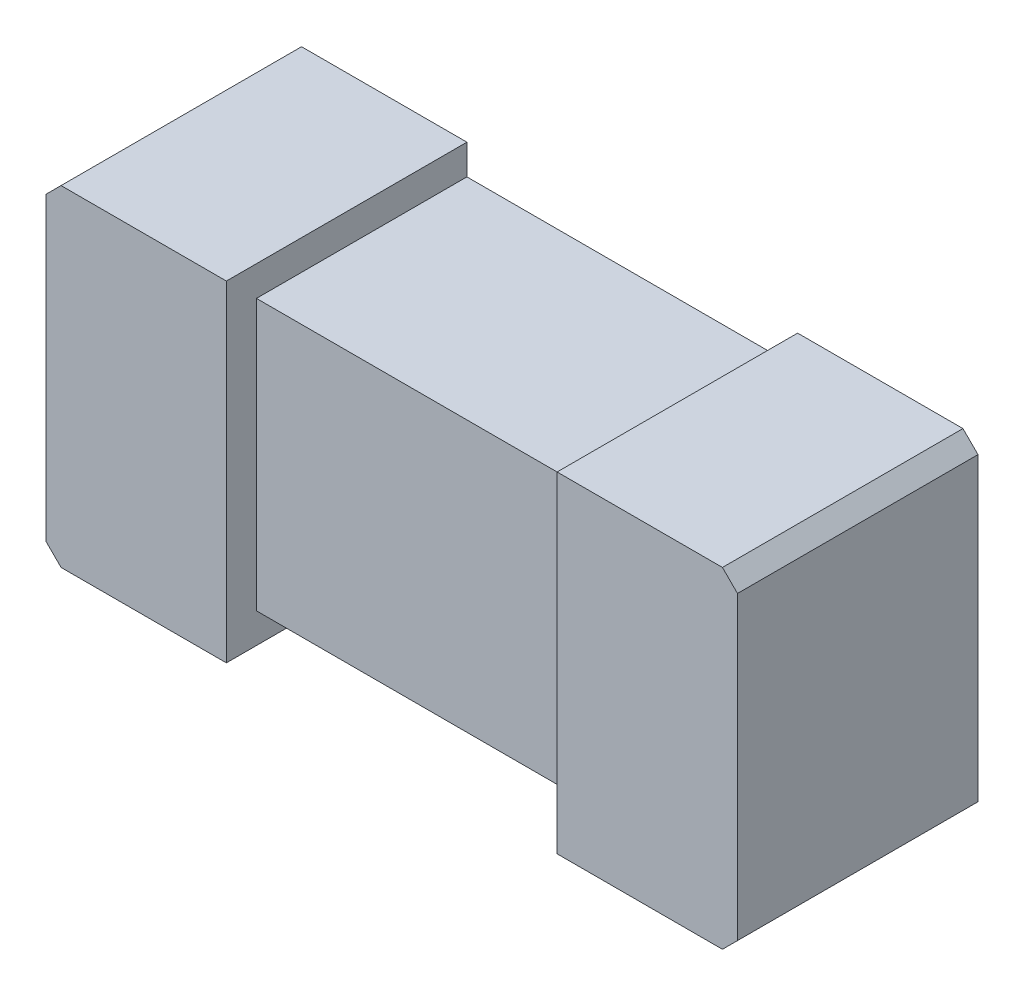
ISO-10303-21;
HEADER;
FILE_DESCRIPTION(('STEP AP214'),'2;1');
FILE_NAME('part.step','',(''),(''),'','','');
FILE_SCHEMA(('AUTOMOTIVE_DESIGN { 1 0 10303 214 1 1 1 1 }'));
ENDSEC;
DATA;
#1=APPLICATION_CONTEXT('core data for automotive mechanical design processes');
#2=APPLICATION_PROTOCOL_DEFINITION('international standard','automotive_design',2000,#1);
#3=PRODUCT_CONTEXT('',#1,'mechanical');
#4=PRODUCT('Part','Part','',(#3));
#5=PRODUCT_RELATED_PRODUCT_CATEGORY('part','',(#4));
#6=PRODUCT_DEFINITION_FORMATION('','',#4);
#7=PRODUCT_DEFINITION_CONTEXT('part definition',#1,'design');
#8=PRODUCT_DEFINITION('design','',#6,#7);
#9=PRODUCT_DEFINITION_SHAPE('','',#8);
#10=(LENGTH_UNIT() NAMED_UNIT(*) SI_UNIT(.MILLI.,.METRE.));
#11=(NAMED_UNIT(*) PLANE_ANGLE_UNIT() SI_UNIT($,.RADIAN.));
#12=(NAMED_UNIT(*) SI_UNIT($,.STERADIAN.) SOLID_ANGLE_UNIT());
#13=UNCERTAINTY_MEASURE_WITH_UNIT(LENGTH_MEASURE(1.E-05),#10,'distance_accuracy_value','');
#14=(GEOMETRIC_REPRESENTATION_CONTEXT(3) GLOBAL_UNCERTAINTY_ASSIGNED_CONTEXT((#13)) GLOBAL_UNIT_ASSIGNED_CONTEXT((#10,
#11,#12)) REPRESENTATION_CONTEXT('',''));
#15=CARTESIAN_POINT('',(0.,0.,0.));
#16=DIRECTION('',(0.,0.,1.));
#17=DIRECTION('',(1.,0.,0.));
#18=AXIS2_PLACEMENT_3D('',#15,#16,#17);
#19=CARTESIAN_POINT('',(0.,0.825000000000002,0.4));
#20=DIRECTION('',(0.,0.,1.));
#21=DIRECTION('',(1.,0.,0.));
#22=AXIS2_PLACEMENT_3D('',#19,#20,#21);
#23=PLANE('',#22);
#24=DIRECTION('',(-1.,0.,0.));
#25=VECTOR('',#24,1.);
#26=CARTESIAN_POINT('',(0.55,0.275,0.4));
#27=LINE('',#26,#25);
#28=CARTESIAN_POINT('',(0.55,0.275,0.4));
#29=VERTEX_POINT('',#28);
#30=CARTESIAN_POINT('',(0.275,0.275,0.4));
#31=VERTEX_POINT('',#30);
#32=EDGE_CURVE('E204',#29,#31,#27,.T.);
#33=ORIENTED_EDGE('',*,*,#32,.T.);
#34=DIRECTION('',(0.,1.,0.));
#35=VECTOR('',#34,1.);
#36=CARTESIAN_POINT('',(0.275,-0.275,0.4));
#37=LINE('',#36,#35);
#38=CARTESIAN_POINT('',(0.275,-0.275,0.4));
#39=VERTEX_POINT('',#38);
#40=EDGE_CURVE('E281',#39,#31,#37,.T.);
#41=ORIENTED_EDGE('',*,*,#40,.F.);
#42=DIRECTION('',(1.,0.,0.));
#43=VECTOR('',#42,1.);
#44=CARTESIAN_POINT('',(-0.55,-0.275,0.4));
#45=LINE('',#44,#43);
#46=CARTESIAN_POINT('',(0.55,-0.275,0.4));
#47=VERTEX_POINT('',#46);
#48=EDGE_CURVE('E213',#39,#47,#45,.T.);
#49=ORIENTED_EDGE('',*,*,#48,.T.);
#50=DIRECTION('',(0.707106781186547,0.707106781186548,0.));
#51=VECTOR('',#50,1.);
#52=CARTESIAN_POINT('',(0.55,-0.275,0.4));
#53=LINE('',#52,#51);
#54=CARTESIAN_POINT('',(0.575,-0.25,0.4));
#55=VERTEX_POINT('',#54);
#56=EDGE_CURVE('E217',#47,#55,#53,.T.);
#57=ORIENTED_EDGE('',*,*,#56,.T.);
#58=DIRECTION('',(0.,1.,0.));
#59=VECTOR('',#58,1.);
#60=CARTESIAN_POINT('',(0.575,-0.25,0.4));
#61=LINE('',#60,#59);
#62=CARTESIAN_POINT('',(0.575,0.25,0.4));
#63=VERTEX_POINT('',#62);
#64=EDGE_CURVE('E219',#55,#63,#61,.T.);
#65=ORIENTED_EDGE('',*,*,#64,.T.);
#66=DIRECTION('',(-0.707106781186547,0.707106781186548,0.));
#67=VECTOR('',#66,1.);
#68=CARTESIAN_POINT('',(0.575,0.25,0.4));
#69=LINE('',#68,#67);
#70=EDGE_CURVE('E200',#63,#29,#69,.T.);
#71=ORIENTED_EDGE('',*,*,#70,.T.);
#72=EDGE_LOOP('',(#33,#41,#49,#57,#65,#71));
#73=FACE_BOUND('',#72,.T.);
#74=ADVANCED_FACE('F36',(#73),#23,.T.);
#75=CARTESIAN_POINT('',(0.55,0.275,0.4));
#76=DIRECTION('',(0.,-1.,0.));
#77=DIRECTION('',(0.,0.,-1.));
#78=AXIS2_PLACEMENT_3D('',#75,#76,#77);
#79=PLANE('',#78);
#80=CARTESIAN_POINT('',(-0.275,0.275,0.4));
#81=VERTEX_POINT('',#80);
#82=CARTESIAN_POINT('',(-0.55,0.275,0.4));
#83=VERTEX_POINT('',#82);
#84=EDGE_CURVE('E203',#81,#83,#27,.T.);
#85=ORIENTED_EDGE('',*,*,#84,.F.);
#86=DIRECTION('',(0.,0.,1.));
#87=VECTOR('',#86,1.);
#88=CARTESIAN_POINT('',(-0.275,0.275,0.));
#89=LINE('',#88,#87);
#90=CARTESIAN_POINT('',(-0.275,0.275,0.));
#91=VERTEX_POINT('',#90);
#92=EDGE_CURVE('E269',#91,#81,#89,.T.);
#93=ORIENTED_EDGE('',*,*,#92,.F.);
#94=DIRECTION('',(-1.,0.,0.));
#95=VECTOR('',#94,1.);
#96=CARTESIAN_POINT('',(0.55,0.275,0.));
#97=LINE('',#96,#95);
#98=CARTESIAN_POINT('',(-0.55,0.275,0.));
#99=VERTEX_POINT('',#98);
#100=EDGE_CURVE('E182',#91,#99,#97,.T.);
#101=ORIENTED_EDGE('',*,*,#100,.T.);
#102=DIRECTION('',(0.,0.,-1.));
#103=VECTOR('',#102,1.);
#104=CARTESIAN_POINT('',(-0.55,0.275,0.4));
#105=LINE('',#104,#103);
#106=EDGE_CURVE('E44',#83,#99,#105,.T.);
#107=ORIENTED_EDGE('',*,*,#106,.F.);
#108=EDGE_LOOP('',(#85,#93,#101,#107));
#109=FACE_BOUND('',#108,.T.);
#110=ADVANCED_FACE('F268',(#109),#79,.F.);
#111=CARTESIAN_POINT('',(-0.55,-0.275,0.4));
#112=DIRECTION('',(0.,1.,0.));
#113=DIRECTION('',(0.,0.,1.));
#114=AXIS2_PLACEMENT_3D('',#111,#112,#113);
#115=PLANE('',#114);
#116=ORIENTED_EDGE('',*,*,#48,.F.);
#117=DIRECTION('',(0.,0.,1.));
#118=VECTOR('',#117,1.);
#119=CARTESIAN_POINT('',(0.275,-0.275,0.));
#120=LINE('',#119,#118);
#121=CARTESIAN_POINT('',(0.275,-0.275,0.));
#122=VERTEX_POINT('',#121);
#123=EDGE_CURVE('E173',#122,#39,#120,.T.);
#124=ORIENTED_EDGE('',*,*,#123,.F.);
#125=DIRECTION('',(1.,0.,0.));
#126=VECTOR('',#125,1.);
#127=CARTESIAN_POINT('',(-0.55,-0.275,0.));
#128=LINE('',#127,#126);
#129=CARTESIAN_POINT('',(0.55,-0.275,0.));
#130=VERTEX_POINT('',#129);
#131=EDGE_CURVE('E192',#122,#130,#128,.T.);
#132=ORIENTED_EDGE('',*,*,#131,.T.);
#133=DIRECTION('',(0.,0.,-1.));
#134=VECTOR('',#133,1.);
#135=CARTESIAN_POINT('',(0.55,-0.275,0.4));
#136=LINE('',#135,#134);
#137=EDGE_CURVE('E227',#47,#130,#136,.T.);
#138=ORIENTED_EDGE('',*,*,#137,.F.);
#139=EDGE_LOOP('',(#116,#124,#132,#138));
#140=FACE_BOUND('',#139,.T.);
#141=ADVANCED_FACE('F294',(#140),#115,.F.);
#142=CARTESIAN_POINT('',(0.575,0.25,0.4));
#143=DIRECTION('',(-0.707106781186548,-0.707106781186547,0.));
#144=DIRECTION('',(0.707106781186547,-0.707106781186548,0.));
#145=AXIS2_PLACEMENT_3D('',#142,#143,#144);
#146=PLANE('',#145);
#147=DIRECTION('',(-0.707106781186547,0.707106781186548,0.));
#148=VECTOR('',#147,1.);
#149=CARTESIAN_POINT('',(0.575,0.25,0.));
#150=LINE('',#149,#148);
#151=CARTESIAN_POINT('',(0.575,0.25,0.));
#152=VERTEX_POINT('',#151);
#153=CARTESIAN_POINT('',(0.55,0.275,0.));
#154=VERTEX_POINT('',#153);
#155=EDGE_CURVE('E179',#152,#154,#150,.T.);
#156=ORIENTED_EDGE('',*,*,#155,.T.);
#157=DIRECTION('',(0.,0.,-1.));
#158=VECTOR('',#157,1.);
#159=CARTESIAN_POINT('',(0.55,0.275,0.4));
#160=LINE('',#159,#158);
#161=EDGE_CURVE('E11',#29,#154,#160,.T.);
#162=ORIENTED_EDGE('',*,*,#161,.F.);
#163=ORIENTED_EDGE('',*,*,#70,.F.);
#164=DIRECTION('',(0.,0.,-1.));
#165=VECTOR('',#164,1.);
#166=CARTESIAN_POINT('',(0.575,0.25,0.4));
#167=LINE('',#166,#165);
#168=EDGE_CURVE('E221',#63,#152,#167,.T.);
#169=ORIENTED_EDGE('',*,*,#168,.T.);
#170=EDGE_LOOP('',(#156,#162,#163,#169));
#171=FACE_BOUND('',#170,.T.);
#172=ADVANCED_FACE('F38',(#171),#146,.F.);
#173=CARTESIAN_POINT('',(0.275,0.275,0.));
#174=VERTEX_POINT('',#173);
#175=EDGE_CURVE('E183',#154,#174,#97,.T.);
#176=ORIENTED_EDGE('',*,*,#175,.T.);
#177=DIRECTION('',(0.,0.,1.));
#178=VECTOR('',#177,1.);
#179=CARTESIAN_POINT('',(0.275,0.275,0.));
#180=LINE('',#179,#178);
#181=EDGE_CURVE('E59',#174,#31,#180,.T.);
#182=ORIENTED_EDGE('',*,*,#181,.T.);
#183=ORIENTED_EDGE('',*,*,#32,.F.);
#184=ORIENTED_EDGE('',*,*,#161,.T.);
#185=EDGE_LOOP('',(#176,#182,#183,#184));
#186=FACE_BOUND('',#185,.T.);
#187=ADVANCED_FACE('F310',(#186),#79,.F.);
#188=CARTESIAN_POINT('',(-0.55,0.275,0.4));
#189=DIRECTION('',(0.707106781186548,-0.707106781186547,0.));
#190=DIRECTION('',(0.707106781186547,0.707106781186548,0.));
#191=AXIS2_PLACEMENT_3D('',#188,#189,#190);
#192=PLANE('',#191);
#193=DIRECTION('',(-0.707106781186547,-0.707106781186548,0.));
#194=VECTOR('',#193,1.);
#195=CARTESIAN_POINT('',(-0.55,0.275,0.));
#196=LINE('',#195,#194);
#197=CARTESIAN_POINT('',(-0.575,0.25,0.));
#198=VERTEX_POINT('',#197);
#199=EDGE_CURVE('E186',#99,#198,#196,.T.);
#200=ORIENTED_EDGE('',*,*,#199,.T.);
#201=DIRECTION('',(0.,0.,-1.));
#202=VECTOR('',#201,1.);
#203=CARTESIAN_POINT('',(-0.575,0.25,0.4));
#204=LINE('',#203,#202);
#205=CARTESIAN_POINT('',(-0.575,0.25,0.4));
#206=VERTEX_POINT('',#205);
#207=EDGE_CURVE('E236',#206,#198,#204,.T.);
#208=ORIENTED_EDGE('',*,*,#207,.F.);
#209=DIRECTION('',(-0.707106781186547,-0.707106781186548,0.));
#210=VECTOR('',#209,1.);
#211=CARTESIAN_POINT('',(-0.55,0.275,0.4));
#212=LINE('',#211,#210);
#213=EDGE_CURVE('E207',#83,#206,#212,.T.);
#214=ORIENTED_EDGE('',*,*,#213,.F.);
#215=ORIENTED_EDGE('',*,*,#106,.T.);
#216=EDGE_LOOP('',(#200,#208,#214,#215));
#217=FACE_BOUND('',#216,.T.);
#218=ADVANCED_FACE('F243',(#217),#192,.F.);
#219=CARTESIAN_POINT('',(-0.575,0.25,0.4));
#220=DIRECTION('',(1.,0.,0.));
#221=DIRECTION('',(0.,0.,-1.));
#222=AXIS2_PLACEMENT_3D('',#219,#220,#221);
#223=PLANE('',#222);
#224=DIRECTION('',(0.,-1.,0.));
#225=VECTOR('',#224,1.);
#226=CARTESIAN_POINT('',(-0.575,0.25,0.));
#227=LINE('',#226,#225);
#228=CARTESIAN_POINT('',(-0.575,-0.25,0.));
#229=VERTEX_POINT('',#228);
#230=EDGE_CURVE('E188',#198,#229,#227,.T.);
#231=ORIENTED_EDGE('',*,*,#230,.T.);
#232=DIRECTION('',(0.,0.,-1.));
#233=VECTOR('',#232,1.);
#234=CARTESIAN_POINT('',(-0.575,-0.25,0.4));
#235=LINE('',#234,#233);
#236=CARTESIAN_POINT('',(-0.575,-0.25,0.4));
#237=VERTEX_POINT('',#236);
#238=EDGE_CURVE('E233',#237,#229,#235,.T.);
#239=ORIENTED_EDGE('',*,*,#238,.F.);
#240=DIRECTION('',(0.,-1.,0.));
#241=VECTOR('',#240,1.);
#242=CARTESIAN_POINT('',(-0.575,0.25,0.4));
#243=LINE('',#242,#241);
#244=EDGE_CURVE('E209',#206,#237,#243,.T.);
#245=ORIENTED_EDGE('',*,*,#244,.F.);
#246=ORIENTED_EDGE('',*,*,#207,.T.);
#247=EDGE_LOOP('',(#231,#239,#245,#246));
#248=FACE_BOUND('',#247,.T.);
#249=ADVANCED_FACE('F256',(#248),#223,.F.);
#250=CARTESIAN_POINT('',(-0.575,-0.25,0.4));
#251=DIRECTION('',(0.707106781186548,0.707106781186547,0.));
#252=DIRECTION('',(-0.707106781186547,0.707106781186548,0.));
#253=AXIS2_PLACEMENT_3D('',#250,#251,#252);
#254=PLANE('',#253);
#255=DIRECTION('',(0.707106781186547,-0.707106781186548,0.));
#256=VECTOR('',#255,1.);
#257=CARTESIAN_POINT('',(-0.575,-0.25,0.));
#258=LINE('',#257,#256);
#259=CARTESIAN_POINT('',(-0.55,-0.275,0.));
#260=VERTEX_POINT('',#259);
#261=EDGE_CURVE('E190',#229,#260,#258,.T.);
#262=ORIENTED_EDGE('',*,*,#261,.T.);
#263=DIRECTION('',(0.,0.,-1.));
#264=VECTOR('',#263,1.);
#265=CARTESIAN_POINT('',(-0.55,-0.275,0.4));
#266=LINE('',#265,#264);
#267=CARTESIAN_POINT('',(-0.55,-0.275,0.4));
#268=VERTEX_POINT('',#267);
#269=EDGE_CURVE('E230',#268,#260,#266,.T.);
#270=ORIENTED_EDGE('',*,*,#269,.F.);
#271=DIRECTION('',(0.707106781186547,-0.707106781186548,0.));
#272=VECTOR('',#271,1.);
#273=CARTESIAN_POINT('',(-0.575,-0.25,0.4));
#274=LINE('',#273,#272);
#275=EDGE_CURVE('E211',#237,#268,#274,.T.);
#276=ORIENTED_EDGE('',*,*,#275,.F.);
#277=ORIENTED_EDGE('',*,*,#238,.T.);
#278=EDGE_LOOP('',(#262,#270,#276,#277));
#279=FACE_BOUND('',#278,.T.);
#280=ADVANCED_FACE('F260',(#279),#254,.F.);
#281=CARTESIAN_POINT('',(-0.275,-0.275,0.));
#282=VERTEX_POINT('',#281);
#283=EDGE_CURVE('E193',#260,#282,#128,.T.);
#284=ORIENTED_EDGE('',*,*,#283,.T.);
#285=DIRECTION('',(0.,0.,1.));
#286=VECTOR('',#285,1.);
#287=CARTESIAN_POINT('',(-0.275,-0.275,0.));
#288=LINE('',#287,#286);
#289=CARTESIAN_POINT('',(-0.275,-0.275,0.4));
#290=VERTEX_POINT('',#289);
#291=EDGE_CURVE('E169',#282,#290,#288,.T.);
#292=ORIENTED_EDGE('',*,*,#291,.T.);
#293=EDGE_CURVE('E214',#268,#290,#45,.T.);
#294=ORIENTED_EDGE('',*,*,#293,.F.);
#295=ORIENTED_EDGE('',*,*,#269,.T.);
#296=EDGE_LOOP('',(#284,#292,#294,#295));
#297=FACE_BOUND('',#296,.T.);
#298=ADVANCED_FACE('F345',(#297),#115,.F.);
#299=CARTESIAN_POINT('',(0.55,-0.275,0.4));
#300=DIRECTION('',(-0.707106781186548,0.707106781186547,0.));
#301=DIRECTION('',(-0.707106781186547,-0.707106781186548,0.));
#302=AXIS2_PLACEMENT_3D('',#299,#300,#301);
#303=PLANE('',#302);
#304=DIRECTION('',(0.707106781186547,0.707106781186548,0.));
#305=VECTOR('',#304,1.);
#306=CARTESIAN_POINT('',(0.55,-0.275,0.));
#307=LINE('',#306,#305);
#308=CARTESIAN_POINT('',(0.575,-0.25,0.));
#309=VERTEX_POINT('',#308);
#310=EDGE_CURVE('E196',#130,#309,#307,.T.);
#311=ORIENTED_EDGE('',*,*,#310,.T.);
#312=DIRECTION('',(0.,0.,-1.));
#313=VECTOR('',#312,1.);
#314=CARTESIAN_POINT('',(0.575,-0.25,0.4));
#315=LINE('',#314,#313);
#316=EDGE_CURVE('E224',#55,#309,#315,.T.);
#317=ORIENTED_EDGE('',*,*,#316,.F.);
#318=ORIENTED_EDGE('',*,*,#56,.F.);
#319=ORIENTED_EDGE('',*,*,#137,.T.);
#320=EDGE_LOOP('',(#311,#317,#318,#319));
#321=FACE_BOUND('',#320,.T.);
#322=ADVANCED_FACE('F299',(#321),#303,.F.);
#323=CARTESIAN_POINT('',(0.575,-0.25,0.4));
#324=DIRECTION('',(-1.,0.,0.));
#325=DIRECTION('',(0.,0.,1.));
#326=AXIS2_PLACEMENT_3D('',#323,#324,#325);
#327=PLANE('',#326);
#328=DIRECTION('',(0.,1.,0.));
#329=VECTOR('',#328,1.);
#330=CARTESIAN_POINT('',(0.575,-0.25,0.));
#331=LINE('',#330,#329);
#332=EDGE_CURVE('E198',#309,#152,#331,.T.);
#333=ORIENTED_EDGE('',*,*,#332,.T.);
#334=ORIENTED_EDGE('',*,*,#168,.F.);
#335=ORIENTED_EDGE('',*,*,#64,.F.);
#336=ORIENTED_EDGE('',*,*,#316,.T.);
#337=EDGE_LOOP('',(#333,#334,#335,#336));
#338=FACE_BOUND('',#337,.T.);
#339=ADVANCED_FACE('F305',(#338),#327,.F.);
#340=DIRECTION('',(0.,-1.,0.));
#341=VECTOR('',#340,1.);
#342=CARTESIAN_POINT('',(-0.275,-0.225,0.4));
#343=LINE('',#342,#341);
#344=EDGE_CURVE('E265',#81,#290,#343,.T.);
#345=ORIENTED_EDGE('',*,*,#344,.F.);
#346=ORIENTED_EDGE('',*,*,#84,.T.);
#347=ORIENTED_EDGE('',*,*,#213,.T.);
#348=ORIENTED_EDGE('',*,*,#244,.T.);
#349=ORIENTED_EDGE('',*,*,#275,.T.);
#350=ORIENTED_EDGE('',*,*,#293,.T.);
#351=EDGE_LOOP('',(#345,#346,#347,#348,#349,#350));
#352=FACE_BOUND('',#351,.T.);
#353=ADVANCED_FACE('F264',(#352),#23,.T.);
#354=CARTESIAN_POINT('',(0.,0.825000000000002,0.));
#355=DIRECTION('',(0.,0.,1.));
#356=DIRECTION('',(1.,0.,0.));
#357=AXIS2_PLACEMENT_3D('',#354,#355,#356);
#358=PLANE('',#357);
#359=ORIENTED_EDGE('',*,*,#100,.F.);
#360=DIRECTION('',(0.,-1.,0.));
#361=VECTOR('',#360,1.);
#362=CARTESIAN_POINT('',(-0.275,0.275,0.));
#363=LINE('',#362,#361);
#364=CARTESIAN_POINT('',(-0.275,0.225,0.));
#365=VERTEX_POINT('',#364);
#366=EDGE_CURVE('E279',#91,#365,#363,.T.);
#367=ORIENTED_EDGE('',*,*,#366,.T.);
#368=DIRECTION('',(1.,0.,0.));
#369=VECTOR('',#368,1.);
#370=CARTESIAN_POINT('',(0.275,0.225,0.));
#371=LINE('',#370,#369);
#372=CARTESIAN_POINT('',(0.275,0.225,0.));
#373=VERTEX_POINT('',#372);
#374=EDGE_CURVE('E314',#365,#373,#371,.T.);
#375=ORIENTED_EDGE('',*,*,#374,.T.);
#376=DIRECTION('',(0.,1.,0.));
#377=VECTOR('',#376,1.);
#378=CARTESIAN_POINT('',(0.275,0.225,0.));
#379=LINE('',#378,#377);
#380=EDGE_CURVE('E312',#373,#174,#379,.T.);
#381=ORIENTED_EDGE('',*,*,#380,.T.);
#382=ORIENTED_EDGE('',*,*,#175,.F.);
#383=ORIENTED_EDGE('',*,*,#155,.F.);
#384=ORIENTED_EDGE('',*,*,#332,.F.);
#385=ORIENTED_EDGE('',*,*,#310,.F.);
#386=ORIENTED_EDGE('',*,*,#131,.F.);
#387=DIRECTION('',(0.,1.,0.));
#388=VECTOR('',#387,1.);
#389=CARTESIAN_POINT('',(0.275,-0.275,0.));
#390=LINE('',#389,#388);
#391=CARTESIAN_POINT('',(0.275,-0.225,0.));
#392=VERTEX_POINT('',#391);
#393=EDGE_CURVE('E170',#122,#392,#390,.T.);
#394=ORIENTED_EDGE('',*,*,#393,.T.);
#395=DIRECTION('',(-1.,0.,0.));
#396=VECTOR('',#395,1.);
#397=CARTESIAN_POINT('',(-0.275,-0.225,0.));
#398=LINE('',#397,#396);
#399=CARTESIAN_POINT('',(-0.275,-0.225,0.));
#400=VERTEX_POINT('',#399);
#401=EDGE_CURVE('E283',#392,#400,#398,.T.);
#402=ORIENTED_EDGE('',*,*,#401,.T.);
#403=DIRECTION('',(0.,-1.,0.));
#404=VECTOR('',#403,1.);
#405=CARTESIAN_POINT('',(-0.275,-0.225,0.));
#406=LINE('',#405,#404);
#407=EDGE_CURVE('E167',#400,#282,#406,.T.);
#408=ORIENTED_EDGE('',*,*,#407,.T.);
#409=ORIENTED_EDGE('',*,*,#283,.F.);
#410=ORIENTED_EDGE('',*,*,#261,.F.);
#411=ORIENTED_EDGE('',*,*,#230,.F.);
#412=ORIENTED_EDGE('',*,*,#199,.F.);
#413=EDGE_LOOP('',(#359,#367,#375,#381,#382,#383,#384,#385,#386,#394,#402,#408,#409,#410,#411,#412));
#414=FACE_BOUND('',#413,.T.);
#415=ADVANCED_FACE('F250',(#414),#358,.F.);
#416=CARTESIAN_POINT('',(-0.275,-0.225,0.));
#417=DIRECTION('',(0.,1.,0.));
#418=DIRECTION('',(-1.,0.,0.));
#419=AXIS2_PLACEMENT_3D('',#416,#417,#418);
#420=PLANE('',#419);
#421=DIRECTION('',(0.,0.,1.));
#422=VECTOR('',#421,1.);
#423=CARTESIAN_POINT('',(0.275,-0.225,0.));
#424=LINE('',#423,#422);
#425=CARTESIAN_POINT('',(0.275,-0.225,0.35));
#426=VERTEX_POINT('',#425);
#427=EDGE_CURVE('E163',#392,#426,#424,.T.);
#428=ORIENTED_EDGE('',*,*,#427,.T.);
#429=DIRECTION('',(1.,0.,0.));
#430=VECTOR('',#429,1.);
#431=CARTESIAN_POINT('',(0.275,-0.225,0.35));
#432=LINE('',#431,#430);
#433=CARTESIAN_POINT('',(-0.275,-0.225,0.35));
#434=VERTEX_POINT('',#433);
#435=EDGE_CURVE('E151',#434,#426,#432,.T.);
#436=ORIENTED_EDGE('',*,*,#435,.F.);
#437=DIRECTION('',(0.,0.,1.));
#438=VECTOR('',#437,1.);
#439=CARTESIAN_POINT('',(-0.275,-0.225,0.));
#440=LINE('',#439,#438);
#441=EDGE_CURVE('E161',#400,#434,#440,.T.);
#442=ORIENTED_EDGE('',*,*,#441,.F.);
#443=ORIENTED_EDGE('',*,*,#401,.F.);
#444=EDGE_LOOP('',(#428,#436,#442,#443));
#445=FACE_BOUND('',#444,.T.);
#446=ADVANCED_FACE('F159',(#445),#420,.F.);
#447=CARTESIAN_POINT('',(0.275,-0.275,0.));
#448=DIRECTION('',(1.,0.,0.));
#449=DIRECTION('',(0.,1.,0.));
#450=AXIS2_PLACEMENT_3D('',#447,#448,#449);
#451=PLANE('',#450);
#452=ORIENTED_EDGE('',*,*,#40,.T.);
#453=ORIENTED_EDGE('',*,*,#181,.F.);
#454=ORIENTED_EDGE('',*,*,#380,.F.);
#455=DIRECTION('',(0.,0.,1.));
#456=VECTOR('',#455,1.);
#457=CARTESIAN_POINT('',(0.275,0.225,0.));
#458=LINE('',#457,#456);
#459=CARTESIAN_POINT('',(0.275,0.225,0.35));
#460=VERTEX_POINT('',#459);
#461=EDGE_CURVE('E273',#373,#460,#458,.T.);
#462=ORIENTED_EDGE('',*,*,#461,.T.);
#463=DIRECTION('',(0.,-1.,0.));
#464=VECTOR('',#463,1.);
#465=CARTESIAN_POINT('',(0.275,4.775,0.35));
#466=LINE('',#465,#464);
#467=EDGE_CURVE('E156',#460,#426,#466,.T.);
#468=ORIENTED_EDGE('',*,*,#467,.T.);
#469=ORIENTED_EDGE('',*,*,#427,.F.);
#470=ORIENTED_EDGE('',*,*,#393,.F.);
#471=ORIENTED_EDGE('',*,*,#123,.T.);
#472=EDGE_LOOP('',(#452,#453,#454,#462,#468,#469,#470,#471));
#473=FACE_BOUND('',#472,.T.);
#474=ADVANCED_FACE('F288',(#473),#451,.F.);
#475=CARTESIAN_POINT('',(-0.275,-0.225,0.));
#476=DIRECTION('',(-1.,0.,0.));
#477=DIRECTION('',(0.,0.,1.));
#478=AXIS2_PLACEMENT_3D('',#475,#476,#477);
#479=PLANE('',#478);
#480=ORIENTED_EDGE('',*,*,#344,.T.);
#481=ORIENTED_EDGE('',*,*,#291,.F.);
#482=ORIENTED_EDGE('',*,*,#407,.F.);
#483=ORIENTED_EDGE('',*,*,#441,.T.);
#484=DIRECTION('',(0.,-1.,0.));
#485=VECTOR('',#484,1.);
#486=CARTESIAN_POINT('',(-0.275,4.775,0.35));
#487=LINE('',#486,#485);
#488=CARTESIAN_POINT('',(-0.275,0.225,0.35));
#489=VERTEX_POINT('',#488);
#490=EDGE_CURVE('E51',#489,#434,#487,.T.);
#491=ORIENTED_EDGE('',*,*,#490,.F.);
#492=DIRECTION('',(0.,0.,1.));
#493=VECTOR('',#492,1.);
#494=CARTESIAN_POINT('',(-0.275,0.225,0.));
#495=LINE('',#494,#493);
#496=EDGE_CURVE('E270',#365,#489,#495,.T.);
#497=ORIENTED_EDGE('',*,*,#496,.F.);
#498=ORIENTED_EDGE('',*,*,#366,.F.);
#499=ORIENTED_EDGE('',*,*,#92,.T.);
#500=EDGE_LOOP('',(#480,#481,#482,#483,#491,#497,#498,#499));
#501=FACE_BOUND('',#500,.T.);
#502=ADVANCED_FACE('F165',(#501),#479,.F.);
#503=CARTESIAN_POINT('',(0.275,0.225,0.));
#504=DIRECTION('',(0.,-1.,0.));
#505=DIRECTION('',(1.,0.,0.));
#506=AXIS2_PLACEMENT_3D('',#503,#504,#505);
#507=PLANE('',#506);
#508=ORIENTED_EDGE('',*,*,#496,.T.);
#509=DIRECTION('',(1.,0.,0.));
#510=VECTOR('',#509,1.);
#511=CARTESIAN_POINT('',(0.275,0.225,0.35));
#512=LINE('',#511,#510);
#513=EDGE_CURVE('E154',#489,#460,#512,.T.);
#514=ORIENTED_EDGE('',*,*,#513,.T.);
#515=ORIENTED_EDGE('',*,*,#461,.F.);
#516=ORIENTED_EDGE('',*,*,#374,.F.);
#517=EDGE_LOOP('',(#508,#514,#515,#516));
#518=FACE_BOUND('',#517,.T.);
#519=ADVANCED_FACE('F320',(#518),#507,.F.);
#520=CARTESIAN_POINT('',(0.275,4.775,0.35));
#521=DIRECTION('',(0.,0.,-1.));
#522=DIRECTION('',(-1.,0.,0.));
#523=AXIS2_PLACEMENT_3D('',#520,#521,#522);
#524=PLANE('',#523);
#525=ORIENTED_EDGE('',*,*,#490,.T.);
#526=ORIENTED_EDGE('',*,*,#435,.T.);
#527=ORIENTED_EDGE('',*,*,#467,.F.);
#528=ORIENTED_EDGE('',*,*,#513,.F.);
#529=EDGE_LOOP('',(#525,#526,#527,#528));
#530=FACE_BOUND('',#529,.T.);
#531=ADVANCED_FACE('F150',(#530),#524,.F.);
#532=CLOSED_SHELL('',(#74,#110,#141,#172,#187,#218,#249,#280,#298,#322,#339,#353,#415,#446,#474,
#502,#519,#531));
#533=MANIFOLD_SOLID_BREP('B2',#532);
#534=ADVANCED_BREP_SHAPE_REPRESENTATION('',(#18,#533),#14);
#535=SHAPE_DEFINITION_REPRESENTATION(#9,#534);
ENDSEC;
END-ISO-10303-21;
